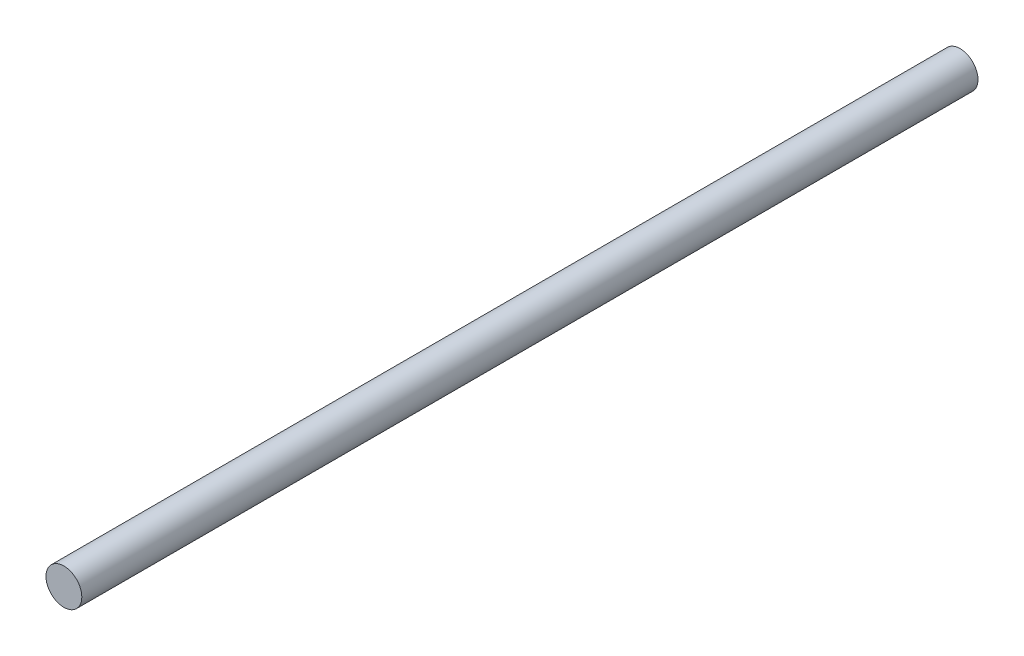
ISO-10303-21;
HEADER;
FILE_DESCRIPTION(('STEP AP214'),'2;1');
FILE_NAME('part.step','',(''),(''),'','','');
FILE_SCHEMA(('AUTOMOTIVE_DESIGN { 1 0 10303 214 1 1 1 1 }'));
ENDSEC;
DATA;
#1=APPLICATION_CONTEXT('core data for automotive mechanical design processes');
#2=APPLICATION_PROTOCOL_DEFINITION('international standard','automotive_design',2000,#1);
#3=PRODUCT_CONTEXT('',#1,'mechanical');
#4=PRODUCT('Part','Part','',(#3));
#5=PRODUCT_RELATED_PRODUCT_CATEGORY('part','',(#4));
#6=PRODUCT_DEFINITION_FORMATION('','',#4);
#7=PRODUCT_DEFINITION_CONTEXT('part definition',#1,'design');
#8=PRODUCT_DEFINITION('design','',#6,#7);
#9=PRODUCT_DEFINITION_SHAPE('','',#8);
#10=(LENGTH_UNIT() NAMED_UNIT(*) SI_UNIT(.MILLI.,.METRE.));
#11=(NAMED_UNIT(*) PLANE_ANGLE_UNIT() SI_UNIT($,.RADIAN.));
#12=(NAMED_UNIT(*) SI_UNIT($,.STERADIAN.) SOLID_ANGLE_UNIT());
#13=UNCERTAINTY_MEASURE_WITH_UNIT(LENGTH_MEASURE(1.E-05),#10,'distance_accuracy_value','');
#14=(GEOMETRIC_REPRESENTATION_CONTEXT(3) GLOBAL_UNCERTAINTY_ASSIGNED_CONTEXT((#13)) GLOBAL_UNIT_ASSIGNED_CONTEXT((#10,
#11,#12)) REPRESENTATION_CONTEXT('',''));
#15=CARTESIAN_POINT('',(0.,0.,0.));
#16=DIRECTION('',(0.,0.,1.));
#17=DIRECTION('',(1.,0.,0.));
#18=AXIS2_PLACEMENT_3D('',#15,#16,#17);
#19=CARTESIAN_POINT('',(-2.6,7.00000000000402,-16.2));
#20=DIRECTION('',(0.,0.,1.));
#21=DIRECTION('',(1.,0.,0.));
#22=AXIS2_PLACEMENT_3D('',#19,#20,#21);
#23=PLANE('',#22);
#24=CARTESIAN_POINT('',(-2.6,7.00000000000402,-16.2));
#25=DIRECTION('',(0.,0.,1.));
#26=DIRECTION('',(-1.,0.,0.));
#27=AXIS2_PLACEMENT_3D('',#24,#25,#26);
#28=CIRCLE('',#27,0.6);
#29=CARTESIAN_POINT('',(-2.,7.00000000000402,-16.2));
#30=VERTEX_POINT('',#29);
#31=EDGE_CURVE('E11',#30,#30,#28,.T.);
#32=ORIENTED_EDGE('',*,*,#31,.F.);
#33=EDGE_LOOP('',(#32));
#34=FACE_BOUND('',#33,.T.);
#35=ADVANCED_FACE('F17',(#34),#23,.F.);
#36=CARTESIAN_POINT('',(-2.6,7.00000000000402,13.8));
#37=DIRECTION('',(0.,0.,1.));
#38=DIRECTION('',(1.,0.,0.));
#39=AXIS2_PLACEMENT_3D('',#36,#37,#38);
#40=PLANE('',#39);
#41=CARTESIAN_POINT('',(-2.6,7.00000000000402,13.8));
#42=DIRECTION('',(0.,0.,1.));
#43=DIRECTION('',(-1.,0.,0.));
#44=AXIS2_PLACEMENT_3D('',#41,#42,#43);
#45=CIRCLE('',#44,0.6);
#46=CARTESIAN_POINT('',(-2.,7.00000000000402,13.8));
#47=VERTEX_POINT('',#46);
#48=EDGE_CURVE('E40',#47,#47,#45,.T.);
#49=ORIENTED_EDGE('',*,*,#48,.T.);
#50=EDGE_LOOP('',(#49));
#51=FACE_BOUND('',#50,.T.);
#52=ADVANCED_FACE('F43',(#51),#40,.T.);
#53=CARTESIAN_POINT('',(-2.6,7.00000000000402,-16.2));
#54=DIRECTION('',(0.,0.,1.));
#55=DIRECTION('',(-1.,0.,0.));
#56=AXIS2_PLACEMENT_3D('',#53,#54,#55);
#57=CYLINDRICAL_SURFACE('',#56,0.6);
#58=ORIENTED_EDGE('',*,*,#48,.F.);
#59=DIRECTION('',(0.,0.,-1.));
#60=VECTOR('',#59,1.);
#61=CARTESIAN_POINT('',(-2.,7.00000000000402,-16.2));
#62=LINE('',#61,#60);
#63=EDGE_CURVE('E21',#47,#30,#62,.T.);
#64=ORIENTED_EDGE('',*,*,#63,.T.);
#65=ORIENTED_EDGE('',*,*,#31,.T.);
#66=ORIENTED_EDGE('',*,*,#63,.F.);
#67=EDGE_LOOP('',(#58,#64,#65,#66));
#68=FACE_BOUND('',#67,.T.);
#69=ADVANCED_FACE('F19',(#68),#57,.T.);
#70=CLOSED_SHELL('',(#35,#52,#69));
#71=MANIFOLD_SOLID_BREP('B1',#70);
#72=ADVANCED_BREP_SHAPE_REPRESENTATION('',(#18,#71),#14);
#73=SHAPE_DEFINITION_REPRESENTATION(#9,#72);
ENDSEC;
END-ISO-10303-21;
